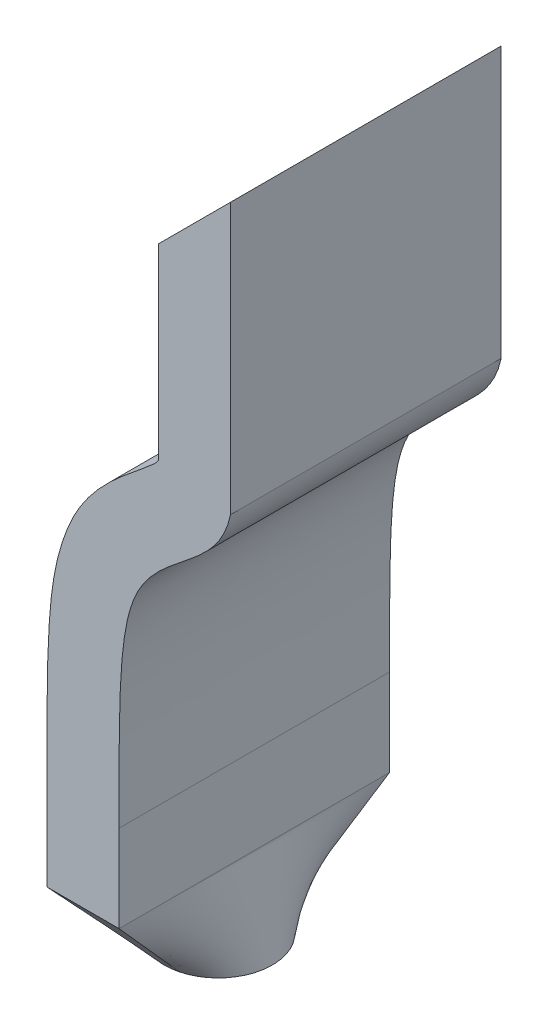
ISO-10303-21;
HEADER;
FILE_DESCRIPTION(('STEP AP214'),'2;1');
FILE_NAME('part.step','',(''),(''),'','','');
FILE_SCHEMA(('AUTOMOTIVE_DESIGN { 1 0 10303 214 1 1 1 1 }'));
ENDSEC;
DATA;
#1=APPLICATION_CONTEXT('core data for automotive mechanical design processes');
#2=APPLICATION_PROTOCOL_DEFINITION('international standard','automotive_design',2000,#1);
#3=PRODUCT_CONTEXT('',#1,'mechanical');
#4=PRODUCT('Part','Part','',(#3));
#5=PRODUCT_RELATED_PRODUCT_CATEGORY('part','',(#4));
#6=PRODUCT_DEFINITION_FORMATION('','',#4);
#7=PRODUCT_DEFINITION_CONTEXT('part definition',#1,'design');
#8=PRODUCT_DEFINITION('design','',#6,#7);
#9=PRODUCT_DEFINITION_SHAPE('','',#8);
#10=(LENGTH_UNIT() NAMED_UNIT(*) SI_UNIT(.MILLI.,.METRE.));
#11=(NAMED_UNIT(*) PLANE_ANGLE_UNIT() SI_UNIT($,.RADIAN.));
#12=(NAMED_UNIT(*) SI_UNIT($,.STERADIAN.) SOLID_ANGLE_UNIT());
#13=UNCERTAINTY_MEASURE_WITH_UNIT(LENGTH_MEASURE(1.E-05),#10,'distance_accuracy_value','');
#14=(GEOMETRIC_REPRESENTATION_CONTEXT(3) GLOBAL_UNCERTAINTY_ASSIGNED_CONTEXT((#13)) GLOBAL_UNIT_ASSIGNED_CONTEXT((#10,
#11,#12)) REPRESENTATION_CONTEXT('',''));
#15=CARTESIAN_POINT('',(0.,0.,0.));
#16=DIRECTION('',(0.,0.,1.));
#17=DIRECTION('',(1.,0.,0.));
#18=AXIS2_PLACEMENT_3D('',#15,#16,#17);
#19=CARTESIAN_POINT('',(-0.4,0.0603528753176714,1.5));
#20=DIRECTION('',(-1.,0.,0.));
#21=DIRECTION('',(0.,-1.,0.));
#22=AXIS2_PLACEMENT_3D('',#19,#20,#21);
#23=PLANE('',#22);
#24=DIRECTION('',(0.,1.,0.));
#25=VECTOR('',#24,1.);
#26=CARTESIAN_POINT('',(-0.4,0.0603528753176714,0.));
#27=LINE('',#26,#25);
#28=CARTESIAN_POINT('',(-0.4,0.0603528753176714,0.));
#29=VERTEX_POINT('',#28);
#30=CARTESIAN_POINT('',(-0.4,1.09999999999999,0.));
#31=VERTEX_POINT('',#30);
#32=EDGE_CURVE('E242',#29,#31,#27,.T.);
#33=ORIENTED_EDGE('',*,*,#32,.F.);
#34=DIRECTION('',(0.,0.,-1.));
#35=VECTOR('',#34,1.);
#36=CARTESIAN_POINT('',(-0.4,0.0603528753176714,1.5));
#37=LINE('',#36,#35);
#38=CARTESIAN_POINT('',(-0.4,0.0603528753176714,1.5));
#39=VERTEX_POINT('',#38);
#40=EDGE_CURVE('E12',#39,#29,#37,.T.);
#41=ORIENTED_EDGE('',*,*,#40,.F.);
#42=DIRECTION('',(0.,1.,0.));
#43=VECTOR('',#42,1.);
#44=CARTESIAN_POINT('',(-0.4,0.0603528753176714,1.5));
#45=LINE('',#44,#43);
#46=CARTESIAN_POINT('',(-0.4,1.09999999999999,1.5));
#47=VERTEX_POINT('',#46);
#48=EDGE_CURVE('E366',#39,#47,#45,.T.);
#49=ORIENTED_EDGE('',*,*,#48,.T.);
#50=DIRECTION('',(0.,0.,-1.));
#51=VECTOR('',#50,1.);
#52=CARTESIAN_POINT('',(-0.4,1.09999999999999,1.5));
#53=LINE('',#52,#51);
#54=EDGE_CURVE('E346',#47,#31,#53,.T.);
#55=ORIENTED_EDGE('',*,*,#54,.T.);
#56=EDGE_LOOP('',(#33,#41,#49,#55));
#57=FACE_BOUND('',#56,.T.);
#58=ADVANCED_FACE('F57',(#57),#23,.T.);
#59=CARTESIAN_POINT('',(-0.4,0.0603528753176714,1.5));
#60=CARTESIAN_POINT('',(-0.409973475803912,0.0448175453066457,1.5));
#61=CARTESIAN_POINT('',(-0.423249665572916,0.0299189850294542,1.5));
#62=CARTESIAN_POINT('',(-0.562369374139436,-0.0837746441104422,1.5));
#63=CARTESIAN_POINT('',(-0.839777589495766,-0.311942137718338,1.5));
#64=CARTESIAN_POINT('',(-0.977221281192489,-0.718214965835149,1.5));
#65=CARTESIAN_POINT('',(-1.00884721266545,-1.01771519334619,1.5));
#66=CARTESIAN_POINT('',(-1.01891300542235,-1.35887456607027,1.5));
#67=CARTESIAN_POINT('',(-1.01824435208662,-1.66958034246129,1.5));
#68=CARTESIAN_POINT('',(-1.01824435208662,-1.81452575164173,1.5));
#69=B_SPLINE_CURVE_WITH_KNOTS('',3,(#59,#60,#61,#62,#63,#64,#65,#66,#67,#68),.UNSPECIFIED.,.F.,
.F.,(4,1,1,1,1,1,1,4),(0.109484601504531,0.220799026316465,0.332113451128398,0.554742300752265,
0.666056725564199,0.777371150376133,0.888685575188066,1.),.UNSPECIFIED.);
#70=DIRECTION('',(0.,0.,-1.));
#71=VECTOR('',#70,1.);
#72=SURFACE_OF_LINEAR_EXTRUSION('',#69,#71);
#73=CARTESIAN_POINT('',(-0.4,0.0603528753176714,0.));
#74=CARTESIAN_POINT('',(-0.409973475803912,0.0448175453066457,0.));
#75=CARTESIAN_POINT('',(-0.423249665572916,0.0299189850294542,0.));
#76=CARTESIAN_POINT('',(-0.562369374139436,-0.0837746441104422,0.));
#77=CARTESIAN_POINT('',(-0.839777589495766,-0.311942137718338,0.));
#78=CARTESIAN_POINT('',(-0.977221281192489,-0.718214965835149,0.));
#79=CARTESIAN_POINT('',(-1.00884721266545,-1.01771519334619,0.));
#80=CARTESIAN_POINT('',(-1.01891300542235,-1.35887456607027,0.));
#81=CARTESIAN_POINT('',(-1.01824435208662,-1.66958034246129,0.));
#82=CARTESIAN_POINT('',(-1.01824435208662,-1.81452575164173,0.));
#83=B_SPLINE_CURVE_WITH_KNOTS('',3,(#73,#74,#75,#76,#77,#78,#79,#80,#81,#82),.UNSPECIFIED.,.F.,
.F.,(4,1,1,1,1,1,1,4),(0.109484601504531,0.220799026316465,0.332113451128398,0.554742300752265,
0.666056725564199,0.777371150376133,0.888685575188066,1.),.UNSPECIFIED.);
#84=CARTESIAN_POINT('',(-1.01824435208662,-1.81452575164173,0.));
#85=VERTEX_POINT('',#84);
#86=EDGE_CURVE('E122',#29,#85,#83,.T.);
#87=ORIENTED_EDGE('',*,*,#86,.T.);
#88=DIRECTION('',(0.,0.,-1.));
#89=VECTOR('',#88,1.);
#90=CARTESIAN_POINT('',(-1.01824435208662,-1.81452575164173,1.5));
#91=LINE('',#90,#89);
#92=CARTESIAN_POINT('',(-1.01824435208662,-1.81452575164173,1.5));
#93=VERTEX_POINT('',#92);
#94=EDGE_CURVE('E67',#93,#85,#91,.T.);
#95=ORIENTED_EDGE('',*,*,#94,.F.);
#96=EDGE_CURVE('E291',#39,#93,#69,.T.);
#97=ORIENTED_EDGE('',*,*,#96,.F.);
#98=ORIENTED_EDGE('',*,*,#40,.T.);
#99=EDGE_LOOP('',(#87,#95,#97,#98));
#100=FACE_BOUND('',#99,.T.);
#101=ADVANCED_FACE('F339',(#100),#72,.F.);
#102=CARTESIAN_POINT('',(-1.01824435208662,-1.81452575164173,1.5));
#103=DIRECTION('',(1.,0.,0.));
#104=DIRECTION('',(0.,0.,-1.));
#105=AXIS2_PLACEMENT_3D('',#102,#103,#104);
#106=PLANE('',#105);
#107=DIRECTION('',(0.,-1.,0.));
#108=VECTOR('',#107,1.);
#109=CARTESIAN_POINT('',(-1.01824435208662,-1.81452575164173,0.));
#110=LINE('',#109,#108);
#111=CARTESIAN_POINT('',(-1.01824435208662,-2.29674260268098,0.));
#112=VERTEX_POINT('',#111);
#113=EDGE_CURVE('E111',#85,#112,#110,.T.);
#114=ORIENTED_EDGE('',*,*,#113,.T.);
#115=DIRECTION('',(0.,0.,-1.));
#116=VECTOR('',#115,1.);
#117=CARTESIAN_POINT('',(-1.01824435208662,-2.29674260268098,1.5));
#118=LINE('',#117,#116);
#119=CARTESIAN_POINT('',(-1.01824435208662,-2.29674260268098,1.5));
#120=VERTEX_POINT('',#119);
#121=EDGE_CURVE('E116',#120,#112,#118,.T.);
#122=ORIENTED_EDGE('',*,*,#121,.F.);
#123=DIRECTION('',(0.,-1.,0.));
#124=VECTOR('',#123,1.);
#125=CARTESIAN_POINT('',(-1.01824435208662,-1.81452575164173,1.5));
#126=LINE('',#125,#124);
#127=EDGE_CURVE('E285',#93,#120,#126,.T.);
#128=ORIENTED_EDGE('',*,*,#127,.F.);
#129=ORIENTED_EDGE('',*,*,#94,.T.);
#130=EDGE_LOOP('',(#114,#122,#128,#129));
#131=FACE_BOUND('',#130,.T.);
#132=ADVANCED_FACE('F113',(#131),#106,.F.);
#133=CARTESIAN_POINT('',(-0.618244352086618,-1.81452575164172,1.5));
#134=DIRECTION('',(1.,0.,0.));
#135=DIRECTION('',(0.,0.,-1.));
#136=AXIS2_PLACEMENT_3D('',#133,#134,#135);
#137=PLANE('',#136);
#138=DIRECTION('',(0.,-1.,0.));
#139=VECTOR('',#138,1.);
#140=CARTESIAN_POINT('',(-0.618244352086618,-1.81452575164172,0.));
#141=LINE('',#140,#139);
#142=CARTESIAN_POINT('',(-0.618244352086618,-1.81452575164172,0.));
#143=VERTEX_POINT('',#142);
#144=CARTESIAN_POINT('',(-0.618244352086618,-2.29674260268098,0.));
#145=VERTEX_POINT('',#144);
#146=EDGE_CURVE('E130',#143,#145,#141,.T.);
#147=ORIENTED_EDGE('',*,*,#146,.F.);
#148=DIRECTION('',(0.,0.,-1.));
#149=VECTOR('',#148,1.);
#150=CARTESIAN_POINT('',(-0.618244352086618,-1.81452575164172,1.5));
#151=LINE('',#150,#149);
#152=CARTESIAN_POINT('',(-0.618244352086618,-1.81452575164172,1.5));
#153=VERTEX_POINT('',#152);
#154=EDGE_CURVE('E273',#153,#143,#151,.T.);
#155=ORIENTED_EDGE('',*,*,#154,.F.);
#156=DIRECTION('',(0.,-1.,0.));
#157=VECTOR('',#156,1.);
#158=CARTESIAN_POINT('',(-0.618244352086618,-1.81452575164172,1.5));
#159=LINE('',#158,#157);
#160=CARTESIAN_POINT('',(-0.618244352086618,-2.29674260268098,1.5));
#161=VERTEX_POINT('',#160);
#162=EDGE_CURVE('E281',#153,#161,#159,.T.);
#163=ORIENTED_EDGE('',*,*,#162,.T.);
#164=DIRECTION('',(0.,0.,-1.));
#165=VECTOR('',#164,1.);
#166=CARTESIAN_POINT('',(-0.618244352086618,-2.29674260268098,1.5));
#167=LINE('',#166,#165);
#168=EDGE_CURVE('E146',#161,#145,#167,.T.);
#169=ORIENTED_EDGE('',*,*,#168,.T.);
#170=EDGE_LOOP('',(#147,#155,#163,#169));
#171=FACE_BOUND('',#170,.T.);
#172=ADVANCED_FACE('F325',(#171),#137,.T.);
#173=CARTESIAN_POINT('',(0.,0.,1.5));
#174=CARTESIAN_POINT('',(-0.0659320767064372,-0.313499233872621,1.5));
#175=CARTESIAN_POINT('',(-0.626607023996278,-0.39746522374652,1.5));
#176=CARTESIAN_POINT('',(-0.618244352086618,-1.18381784942876,1.5));
#177=CARTESIAN_POINT('',(-0.618244352086618,-1.81452575164173,1.5));
#178=B_SPLINE_CURVE_WITH_KNOTS('',3,(#173,#174,#175,#176,#177),.UNSPECIFIED.,.F.,.F.,(4,1,4),
(0.,0.565457771292375,1.),.UNSPECIFIED.);
#179=DIRECTION('',(0.,0.,-1.));
#180=VECTOR('',#179,1.);
#181=SURFACE_OF_LINEAR_EXTRUSION('',#178,#180);
#182=CARTESIAN_POINT('',(0.,0.,0.));
#183=CARTESIAN_POINT('',(-0.0659320767064372,-0.313499233872621,0.));
#184=CARTESIAN_POINT('',(-0.626607023996278,-0.39746522374652,0.));
#185=CARTESIAN_POINT('',(-0.618244352086618,-1.18381784942876,0.));
#186=CARTESIAN_POINT('',(-0.618244352086618,-1.81452575164173,0.));
#187=B_SPLINE_CURVE_WITH_KNOTS('',3,(#182,#183,#184,#185,#186),.UNSPECIFIED.,.F.,.F.,(4,1,4),
(0.,0.565457771292375,1.),.UNSPECIFIED.);
#188=CARTESIAN_POINT('',(0.,0.,0.));
#189=VERTEX_POINT('',#188);
#190=EDGE_CURVE('E356',#189,#143,#187,.T.);
#191=ORIENTED_EDGE('',*,*,#190,.F.);
#192=DIRECTION('',(0.,0.,-1.));
#193=VECTOR('',#192,1.);
#194=CARTESIAN_POINT('',(0.,0.,1.5));
#195=LINE('',#194,#193);
#196=CARTESIAN_POINT('',(0.,0.,1.5));
#197=VERTEX_POINT('',#196);
#198=EDGE_CURVE('E277',#197,#189,#195,.T.);
#199=ORIENTED_EDGE('',*,*,#198,.F.);
#200=EDGE_CURVE('E293',#197,#153,#178,.T.);
#201=ORIENTED_EDGE('',*,*,#200,.T.);
#202=ORIENTED_EDGE('',*,*,#154,.T.);
#203=EDGE_LOOP('',(#191,#199,#201,#202));
#204=FACE_BOUND('',#203,.T.);
#205=ADVANCED_FACE('F320',(#204),#181,.T.);
#206=CARTESIAN_POINT('',(0.,0.,1.5));
#207=DIRECTION('',(-1.,0.,0.));
#208=DIRECTION('',(0.,0.,1.));
#209=AXIS2_PLACEMENT_3D('',#206,#207,#208);
#210=PLANE('',#209);
#211=DIRECTION('',(0.,1.,0.));
#212=VECTOR('',#211,1.);
#213=CARTESIAN_POINT('',(0.,0.,0.));
#214=LINE('',#213,#212);
#215=CARTESIAN_POINT('',(0.,1.5,0.));
#216=VERTEX_POINT('',#215);
#217=EDGE_CURVE('E351',#189,#216,#214,.T.);
#218=ORIENTED_EDGE('',*,*,#217,.T.);
#219=DIRECTION('',(0.,0.,-1.));
#220=VECTOR('',#219,1.);
#221=CARTESIAN_POINT('',(0.,1.5,1.5));
#222=LINE('',#221,#220);
#223=CARTESIAN_POINT('',(0.,1.5,1.5));
#224=VERTEX_POINT('',#223);
#225=EDGE_CURVE('E374',#224,#216,#222,.T.);
#226=ORIENTED_EDGE('',*,*,#225,.F.);
#227=DIRECTION('',(0.,1.,0.));
#228=VECTOR('',#227,1.);
#229=CARTESIAN_POINT('',(0.,0.,1.5));
#230=LINE('',#229,#228);
#231=EDGE_CURVE('E297',#197,#224,#230,.T.);
#232=ORIENTED_EDGE('',*,*,#231,.F.);
#233=ORIENTED_EDGE('',*,*,#198,.T.);
#234=EDGE_LOOP('',(#218,#226,#232,#233));
#235=FACE_BOUND('',#234,.T.);
#236=ADVANCED_FACE('F324',(#235),#210,.F.);
#237=CARTESIAN_POINT('',(0.,1.5,1.5));
#238=DIRECTION('',(0.707106781186553,-0.707106781186541,0.));
#239=DIRECTION('',(0.707106781186542,0.707106781186554,0.));
#240=AXIS2_PLACEMENT_3D('',#237,#238,#239);
#241=PLANE('',#240);
#242=DIRECTION('',(-0.707106781186541,-0.707106781186554,0.));
#243=VECTOR('',#242,1.);
#244=CARTESIAN_POINT('',(0.,1.5,0.));
#245=LINE('',#244,#243);
#246=EDGE_CURVE('E349',#216,#31,#245,.T.);
#247=ORIENTED_EDGE('',*,*,#246,.T.);
#248=ORIENTED_EDGE('',*,*,#54,.F.);
#249=DIRECTION('',(-0.707106781186541,-0.707106781186554,0.));
#250=VECTOR('',#249,1.);
#251=CARTESIAN_POINT('',(0.,1.5,1.5));
#252=LINE('',#251,#250);
#253=EDGE_CURVE('E305',#224,#47,#252,.T.);
#254=ORIENTED_EDGE('',*,*,#253,.F.);
#255=ORIENTED_EDGE('',*,*,#225,.T.);
#256=EDGE_LOOP('',(#247,#248,#254,#255));
#257=FACE_BOUND('',#256,.T.);
#258=ADVANCED_FACE('F328',(#257),#241,.F.);
#259=CARTESIAN_POINT('',(-0.464504660204243,-0.546825804193222,1.5));
#260=DIRECTION('',(0.,0.,1.));
#261=DIRECTION('',(1.,0.,0.));
#262=AXIS2_PLACEMENT_3D('',#259,#260,#261);
#263=PLANE('',#262);
#264=ORIENTED_EDGE('',*,*,#48,.F.);
#265=ORIENTED_EDGE('',*,*,#96,.T.);
#266=ORIENTED_EDGE('',*,*,#127,.T.);
#267=DIRECTION('',(1.,0.,0.));
#268=VECTOR('',#267,1.);
#269=CARTESIAN_POINT('',(-0.464504660204243,-2.29674260268098,1.5));
#270=LINE('',#269,#268);
#271=EDGE_CURVE('E283',#120,#161,#270,.T.);
#272=ORIENTED_EDGE('',*,*,#271,.T.);
#273=ORIENTED_EDGE('',*,*,#162,.F.);
#274=ORIENTED_EDGE('',*,*,#200,.F.);
#275=ORIENTED_EDGE('',*,*,#231,.T.);
#276=ORIENTED_EDGE('',*,*,#253,.T.);
#277=EDGE_LOOP('',(#264,#265,#266,#272,#273,#274,#275,#276));
#278=FACE_BOUND('',#277,.T.);
#279=ADVANCED_FACE('F331',(#278),#263,.T.);
#280=CARTESIAN_POINT('',(-0.464504660204243,-0.546825804193222,0.));
#281=DIRECTION('',(0.,0.,1.));
#282=DIRECTION('',(1.,0.,0.));
#283=AXIS2_PLACEMENT_3D('',#280,#281,#282);
#284=PLANE('',#283);
#285=ORIENTED_EDGE('',*,*,#32,.T.);
#286=ORIENTED_EDGE('',*,*,#246,.F.);
#287=ORIENTED_EDGE('',*,*,#217,.F.);
#288=ORIENTED_EDGE('',*,*,#190,.T.);
#289=ORIENTED_EDGE('',*,*,#146,.T.);
#290=DIRECTION('',(1.,0.,0.));
#291=VECTOR('',#290,1.);
#292=CARTESIAN_POINT('',(-0.464504660204243,-2.29674260268098,0.));
#293=LINE('',#292,#291);
#294=EDGE_CURVE('E60',#112,#145,#293,.T.);
#295=ORIENTED_EDGE('',*,*,#294,.F.);
#296=ORIENTED_EDGE('',*,*,#113,.F.);
#297=ORIENTED_EDGE('',*,*,#86,.F.);
#298=EDGE_LOOP('',(#285,#286,#287,#288,#289,#295,#296,#297));
#299=FACE_BOUND('',#298,.T.);
#300=ADVANCED_FACE('F127',(#299),#284,.F.);
#301=CARTESIAN_POINT('',(-0.818244352086618,-2.79674260268098,0.75));
#302=DIRECTION('',(0.,-1.,0.));
#303=DIRECTION('',(0.,0.,-1.));
#304=AXIS2_PLACEMENT_3D('',#301,#302,#303);
#305=PLANE('',#304);
#306=CARTESIAN_POINT('',(-0.740945556918518,-2.79674260268098,1.03987048188037));
#307=CARTESIAN_POINT('',(-0.765841822478684,-2.79674260268098,1.04650948602975));
#308=CARTESIAN_POINT('',(-0.792043087282651,-2.79674260268098,1.04982898810444));
#309=CARTESIAN_POINT('',(-0.844445616890585,-2.79674260268098,1.04982898810444));
#310=CARTESIAN_POINT('',(-0.870646881694551,-2.79674260268098,1.04650948602975));
#311=CARTESIAN_POINT('',(-0.895543147254717,-2.79674260268098,1.03987048188037));
#312=B_SPLINE_CURVE_WITH_KNOTS('',3,(#306,#307,#308,#309,#310,#311),.UNSPECIFIED.,.F.,.F.,(4,2,
4),(0.,0.5,1.),.UNSPECIFIED.);
#313=CARTESIAN_POINT('',(-0.895543147254717,-2.79674260268098,1.03987048188037));
#314=VERTEX_POINT('',#313);
#315=CARTESIAN_POINT('',(-0.740945556918518,-2.79674260268098,1.03987048188037));
#316=VERTEX_POINT('',#315);
#317=EDGE_CURVE('E153',#314,#316,#312,.F.);
#318=ORIENTED_EDGE('',*,*,#317,.F.);
#319=CARTESIAN_POINT('',(-0.818244352086618,-2.79674260268098,0.75));
#320=DIRECTION('',(0.,-1.,0.));
#321=DIRECTION('',(0.,0.,-1.));
#322=AXIS2_PLACEMENT_3D('',#319,#320,#321);
#323=CIRCLE('',#322,0.3);
#324=CARTESIAN_POINT('',(-0.895543147254718,-2.79674260268098,0.460129518119626));
#325=VERTEX_POINT('',#324);
#326=EDGE_CURVE('E232',#314,#325,#323,.T.);
#327=ORIENTED_EDGE('',*,*,#326,.T.);
#328=CARTESIAN_POINT('',(-0.740945556918518,-2.79674260268098,0.460129518119626));
#329=VERTEX_POINT('',#328);
#330=EDGE_CURVE('E150',#325,#329,#323,.T.);
#331=ORIENTED_EDGE('',*,*,#330,.T.);
#332=EDGE_CURVE('E175',#329,#316,#323,.T.);
#333=ORIENTED_EDGE('',*,*,#332,.T.);
#334=EDGE_LOOP('',(#318,#327,#331,#333));
#335=FACE_BOUND('',#334,.T.);
#336=ADVANCED_FACE('F204',(#335),#305,.T.);
#337=CARTESIAN_POINT('',(-0.618244352086618,-2.29674260268098,0.));
#338=CARTESIAN_POINT('',(-0.740945556918518,-2.79674260268098,0.460129518119626));
#339=CARTESIAN_POINT('',(-0.618244352086618,-2.29674260268098,0.125));
#340=CARTESIAN_POINT('',(-0.694265058993207,-2.79674260268098,0.472577650899709));
#341=CARTESIAN_POINT('',(-0.618244352086618,-2.29674260268098,0.25));
#342=CARTESIAN_POINT('',(-0.640218460819253,-2.79674260268098,0.499422848173886));
#343=CARTESIAN_POINT('',(-0.618244352086618,-2.29674260268098,0.5));
#344=CARTESIAN_POINT('',(-0.550575921242712,-2.79674260268098,0.598885016929531));
#345=CARTESIAN_POINT('',(-0.618244352086618,-2.29674260268098,0.625));
#346=CARTESIAN_POINT('',(-0.518244352086618,-2.79674260268098,0.6731721686916));
#347=CARTESIAN_POINT('',(-0.618244352086618,-2.29674260268098,0.875));
#348=CARTESIAN_POINT('',(-0.518244352086618,-2.79674260268098,0.8268278313084));
#349=CARTESIAN_POINT('',(-0.618244352086618,-2.29674260268098,1.));
#350=CARTESIAN_POINT('',(-0.550575921242712,-2.79674260268098,0.901114983070469));
#351=CARTESIAN_POINT('',(-0.618244352086618,-2.29674260268098,1.25));
#352=CARTESIAN_POINT('',(-0.640218460819253,-2.79674260268098,1.00057715182611));
#353=CARTESIAN_POINT('',(-0.618244352086618,-2.29674260268098,1.375));
#354=CARTESIAN_POINT('',(-0.694265058993207,-2.79674260268098,1.02742234910029));
#355=CARTESIAN_POINT('',(-0.618244352086618,-2.29674260268098,1.5));
#356=CARTESIAN_POINT('',(-0.740945556918518,-2.79674260268098,1.03987048188037));
#357=B_SPLINE_SURFACE_WITH_KNOTS('',3,1,((#337,#338),(#339,#340),(#341,#342),(#343,#344),(#345,
#346),(#347,#348),(#349,#350),(#351,#352),(#353,#354),(#355,#356)),.UNSPECIFIED.,.F.,.F.,.F.,(4,
2,2,2,4),(2,2),(0.,0.25,0.5,0.75,1.),(0.,1.),.UNSPECIFIED.);
#358=DIRECTION('',(-0.177701952437388,-0.724124725102898,-0.666382321640207));
#359=VECTOR('',#358,1.);
#360=CARTESIAN_POINT('',(-0.679594954502568,-2.54674260268098,1.26993524094019));
#361=LINE('',#360,#359);
#362=EDGE_CURVE('E169',#161,#316,#361,.T.);
#363=DIRECTION('',(0.177701952437389,0.724124725102898,-0.666382321640207));
#364=VECTOR('',#363,1.);
#365=CARTESIAN_POINT('',(-0.679594954502568,-2.54674260268098,0.230064759059813));
#366=LINE('',#365,#364);
#367=EDGE_CURVE('E166',#329,#145,#366,.T.);
#368=ORIENTED_EDGE('',*,*,#168,.F.);
#369=ORIENTED_EDGE('',*,*,#362,.T.);
#370=ORIENTED_EDGE('',*,*,#332,.F.);
#371=ORIENTED_EDGE('',*,*,#367,.T.);
#372=EDGE_LOOP('',(#368,#369,#370,#371));
#373=FACE_BOUND('',#372,.T.);
#374=ADVANCED_FACE('F191',(#373),#357,.T.);
#375=CARTESIAN_POINT('',(-0.618244352086618,-2.29674260268098,1.5));
#376=CARTESIAN_POINT('',(-0.740945556918518,-2.79674260268098,1.03987048188037));
#377=CARTESIAN_POINT('',(-0.684911018753284,-2.29674260268098,1.5));
#378=CARTESIAN_POINT('',(-0.765841822478684,-2.79674260268098,1.04650948602975));
#379=CARTESIAN_POINT('',(-0.75157768541995,-2.29674260268098,1.5));
#380=CARTESIAN_POINT('',(-0.792043087282651,-2.79674260268098,1.04982898810444));
#381=CARTESIAN_POINT('',(-0.884911018753284,-2.29674260268098,1.5));
#382=CARTESIAN_POINT('',(-0.844445616890585,-2.79674260268098,1.04982898810444));
#383=CARTESIAN_POINT('',(-0.951577685419951,-2.29674260268098,1.5));
#384=CARTESIAN_POINT('',(-0.870646881694551,-2.79674260268098,1.04650948602975));
#385=CARTESIAN_POINT('',(-1.01824435208662,-2.29674260268098,1.5));
#386=CARTESIAN_POINT('',(-0.895543147254717,-2.79674260268098,1.03987048188037));
#387=B_SPLINE_SURFACE_WITH_KNOTS('',3,1,((#375,#376),(#377,#378),(#379,#380),(#381,#382),(#383,
#384),(#385,#386)),.UNSPECIFIED.,.F.,.F.,.F.,(4,2,4),(2,2),(0.,0.5,1.),(0.,1.),.UNSPECIFIED.);
#388=DIRECTION('',(0.177701952437388,-0.724124725102898,-0.666382321640207));
#389=VECTOR('',#388,1.);
#390=CARTESIAN_POINT('',(-0.956893749670667,-2.54674260268098,1.26993524094019));
#391=LINE('',#390,#389);
#392=EDGE_CURVE('E144',#120,#314,#391,.T.);
#393=ORIENTED_EDGE('',*,*,#271,.F.);
#394=ORIENTED_EDGE('',*,*,#392,.T.);
#395=ORIENTED_EDGE('',*,*,#317,.T.);
#396=ORIENTED_EDGE('',*,*,#362,.F.);
#397=EDGE_LOOP('',(#393,#394,#395,#396));
#398=FACE_BOUND('',#397,.T.);
#399=ADVANCED_FACE('F203',(#398),#387,.T.);
#400=CARTESIAN_POINT('',(-1.01824435208662,-2.29674260268098,0.));
#401=CARTESIAN_POINT('',(-0.895543147254718,-2.79674260268098,0.460129518119626));
#402=CARTESIAN_POINT('',(-0.951577685419951,-2.29674260268098,0.));
#403=CARTESIAN_POINT('',(-0.870646881694552,-2.79674260268098,0.453490513970249));
#404=CARTESIAN_POINT('',(-0.884911018753285,-2.29674260268098,0.));
#405=CARTESIAN_POINT('',(-0.844445616890585,-2.79674260268098,0.45017101189556));
#406=CARTESIAN_POINT('',(-0.751577685419951,-2.29674260268098,0.));
#407=CARTESIAN_POINT('',(-0.792043087282651,-2.79674260268098,0.45017101189556));
#408=CARTESIAN_POINT('',(-0.684911018753285,-2.29674260268098,0.));
#409=CARTESIAN_POINT('',(-0.765841822478684,-2.79674260268098,0.453490513970249));
#410=CARTESIAN_POINT('',(-0.618244352086618,-2.29674260268098,0.));
#411=CARTESIAN_POINT('',(-0.740945556918518,-2.79674260268098,0.460129518119626));
#412=B_SPLINE_SURFACE_WITH_KNOTS('',3,1,((#400,#401),(#402,#403),(#404,#405),(#406,#407),(#408,
#409),(#410,#411)),.UNSPECIFIED.,.F.,.F.,.F.,(4,2,4),(2,2),(0.,0.5,1.),(0.,1.),.UNSPECIFIED.);
#413=DIRECTION('',(0.177701952437388,-0.724124725102898,0.666382321640207));
#414=VECTOR('',#413,1.);
#415=CARTESIAN_POINT('',(-0.956893749670668,-2.54674260268098,0.230064759059813));
#416=LINE('',#415,#414);
#417=EDGE_CURVE('E142',#112,#325,#416,.T.);
#418=ORIENTED_EDGE('',*,*,#294,.T.);
#419=ORIENTED_EDGE('',*,*,#367,.F.);
#420=ORIENTED_EDGE('',*,*,#330,.F.);
#421=ORIENTED_EDGE('',*,*,#417,.F.);
#422=EDGE_LOOP('',(#418,#419,#420,#421));
#423=FACE_BOUND('',#422,.T.);
#424=ADVANCED_FACE('F148',(#423),#412,.T.);
#425=CARTESIAN_POINT('',(-1.01824435208662,-2.29674260268098,1.5));
#426=CARTESIAN_POINT('',(-0.895543147254717,-2.79674260268098,1.03987048188037));
#427=CARTESIAN_POINT('',(-1.01824435208662,-2.29674260268098,1.375));
#428=CARTESIAN_POINT('',(-0.942223645180029,-2.79674260268098,1.02742234910029));
#429=CARTESIAN_POINT('',(-1.01824435208662,-2.29674260268098,1.25));
#430=CARTESIAN_POINT('',(-0.996270243353982,-2.79674260268098,1.00057715182611));
#431=CARTESIAN_POINT('',(-1.01824435208662,-2.29674260268098,1.));
#432=CARTESIAN_POINT('',(-1.08591278293052,-2.79674260268098,0.901114983070468));
#433=CARTESIAN_POINT('',(-1.01824435208662,-2.29674260268098,0.875));
#434=CARTESIAN_POINT('',(-1.11824435208662,-2.79674260268098,0.8268278313084));
#435=CARTESIAN_POINT('',(-1.01824435208662,-2.29674260268098,0.625));
#436=CARTESIAN_POINT('',(-1.11824435208662,-2.79674260268098,0.6731721686916));
#437=CARTESIAN_POINT('',(-1.01824435208662,-2.29674260268098,0.5));
#438=CARTESIAN_POINT('',(-1.08591278293052,-2.79674260268098,0.598885016929531));
#439=CARTESIAN_POINT('',(-1.01824435208662,-2.29674260268098,0.25));
#440=CARTESIAN_POINT('',(-0.996270243353982,-2.79674260268098,0.499422848173886));
#441=CARTESIAN_POINT('',(-1.01824435208662,-2.29674260268098,0.125));
#442=CARTESIAN_POINT('',(-0.942223645180029,-2.79674260268098,0.472577650899709));
#443=CARTESIAN_POINT('',(-1.01824435208662,-2.29674260268098,0.));
#444=CARTESIAN_POINT('',(-0.895543147254718,-2.79674260268098,0.460129518119626));
#445=B_SPLINE_SURFACE_WITH_KNOTS('',3,1,((#425,#426),(#427,#428),(#429,#430),(#431,#432),(#433,
#434),(#435,#436),(#437,#438),(#439,#440),(#441,#442),(#443,#444)),.UNSPECIFIED.,.F.,.F.,.F.,(4,
2,2,2,4),(2,2),(0.,0.25,0.5,0.75,1.),(0.,1.),.UNSPECIFIED.);
#446=ORIENTED_EDGE('',*,*,#121,.T.);
#447=ORIENTED_EDGE('',*,*,#417,.T.);
#448=ORIENTED_EDGE('',*,*,#326,.F.);
#449=ORIENTED_EDGE('',*,*,#392,.F.);
#450=EDGE_LOOP('',(#446,#447,#448,#449));
#451=FACE_BOUND('',#450,.T.);
#452=ADVANCED_FACE('F140',(#451),#445,.T.);
#453=CLOSED_SHELL('',(#58,#101,#132,#172,#205,#236,#258,#279,#300,#336,#374,#399,#424,#452));
#454=MANIFOLD_SOLID_BREP('B2',#453);
#455=ADVANCED_BREP_SHAPE_REPRESENTATION('',(#18,#454),#14);
#456=SHAPE_DEFINITION_REPRESENTATION(#9,#455);
ENDSEC;
END-ISO-10303-21;
